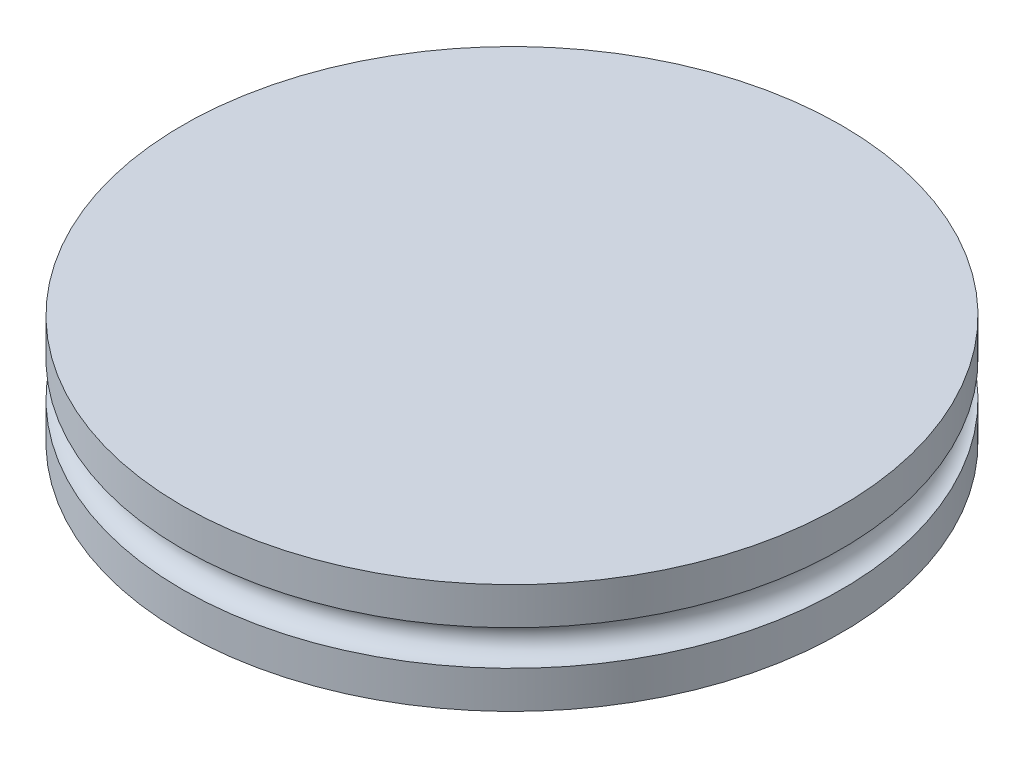
ISO-10303-21;
HEADER;
FILE_DESCRIPTION(('STEP AP214'),'2;1');
FILE_NAME('part.step','',(''),(''),'','','');
FILE_SCHEMA(('AUTOMOTIVE_DESIGN { 1 0 10303 214 1 1 1 1 }'));
ENDSEC;
DATA;
#1=APPLICATION_CONTEXT('core data for automotive mechanical design processes');
#2=APPLICATION_PROTOCOL_DEFINITION('international standard','automotive_design',2000,#1);
#3=PRODUCT_CONTEXT('',#1,'mechanical');
#4=PRODUCT('Part','Part','',(#3));
#5=PRODUCT_RELATED_PRODUCT_CATEGORY('part','',(#4));
#6=PRODUCT_DEFINITION_FORMATION('','',#4);
#7=PRODUCT_DEFINITION_CONTEXT('part definition',#1,'design');
#8=PRODUCT_DEFINITION('design','',#6,#7);
#9=PRODUCT_DEFINITION_SHAPE('','',#8);
#10=(LENGTH_UNIT() NAMED_UNIT(*) SI_UNIT(.MILLI.,.METRE.));
#11=(NAMED_UNIT(*) PLANE_ANGLE_UNIT() SI_UNIT($,.RADIAN.));
#12=(NAMED_UNIT(*) SI_UNIT($,.STERADIAN.) SOLID_ANGLE_UNIT());
#13=UNCERTAINTY_MEASURE_WITH_UNIT(LENGTH_MEASURE(1.E-05),#10,'distance_accuracy_value','');
#14=(GEOMETRIC_REPRESENTATION_CONTEXT(3) GLOBAL_UNCERTAINTY_ASSIGNED_CONTEXT((#13)) GLOBAL_UNIT_ASSIGNED_CONTEXT((#10,
#11,#12)) REPRESENTATION_CONTEXT('',''));
#15=CARTESIAN_POINT('',(0.,0.,0.));
#16=DIRECTION('',(0.,0.,1.));
#17=DIRECTION('',(1.,0.,0.));
#18=AXIS2_PLACEMENT_3D('',#15,#16,#17);
#19=CARTESIAN_POINT('',(-8.509,1.5875,-25.4));
#20=DIRECTION('',(0.,0.,1.));
#21=DIRECTION('',(1.,0.,0.));
#22=AXIS2_PLACEMENT_3D('',#19,#20,#21);
#23=CYLINDRICAL_SURFACE('',#22,0.508);
#24=DIRECTION('',(0.,0.,-1.));
#25=VECTOR('',#24,1.);
#26=CARTESIAN_POINT('',(-8.509,2.0955,-0.254));
#27=LINE('',#26,#25);
#28=CARTESIAN_POINT('',(-8.509,2.0955,-0.254000000000001));
#29=VERTEX_POINT('',#28);
#30=CARTESIAN_POINT('',(-8.509,2.0955,-4.28048408477359));
#31=VERTEX_POINT('',#30);
#32=EDGE_CURVE('E63',#29,#31,#27,.T.);
#33=ORIENTED_EDGE('',*,*,#32,.T.);
#34=CARTESIAN_POINT('',(-8.509,2.0955,-4.28048408477359));
#35=CARTESIAN_POINT('',(-8.50681940239708,2.0955000643981,-4.27996650738304));
#36=CARTESIAN_POINT('',(-8.50463851031945,2.09548601567002,-4.27944876479485));
#37=CARTESIAN_POINT('',(-8.47334904880648,2.09508220074798,-4.27201930151602));
#38=CARTESIAN_POINT('',(-8.44422351393519,2.09219517271686,-4.26508673484259));
#39=CARTESIAN_POINT('',(-8.38680525791417,2.08145280053674,-4.2513870031378));
#40=CARTESIAN_POINT('',(-8.35851501139858,2.07358399441802,-4.24462033803862));
#41=CARTESIAN_POINT('',(-8.3036379450045,2.05306136100023,-4.23146446656607));
#42=CARTESIAN_POINT('',(-8.27705035690713,2.0404097097057,-4.22507509006751));
#43=CARTESIAN_POINT('',(-8.22637851678168,2.01064540053796,-4.2128724650318));
#44=CARTESIAN_POINT('',(-8.20229255813756,1.99353581220859,-4.20705882385462));
#45=CARTESIAN_POINT('',(-8.15763485240061,1.95554209656544,-4.19626010379111));
#46=CARTESIAN_POINT('',(-8.13702246613401,1.93470851114163,-4.19126546482783));
#47=CARTESIAN_POINT('',(-8.09960560377008,1.88968652030876,-4.18218546511635));
#48=CARTESIAN_POINT('',(-8.0828010449163,1.86549818782767,-4.17810008460706));
#49=CARTESIAN_POINT('',(-8.05396792211863,1.81515831259967,-4.17108269505385));
#50=CARTESIAN_POINT('',(-8.04182209995606,1.78907788124975,-4.16812238895205));
#51=CARTESIAN_POINT('',(-8.02208439569524,1.73515210757441,-4.16330846045093));
#52=CARTESIAN_POINT('',(-8.01449168025129,1.70730708924988,-4.16145463553493));
#53=CARTESIAN_POINT('',(-8.00425436009856,1.65139931441966,-4.15895448351195));
#54=CARTESIAN_POINT('',(-8.00148963508401,1.62335981633516,-4.15827884380703));
#55=CARTESIAN_POINT('',(-8.00062961447883,1.56720620180456,-4.15806870967637));
#56=CARTESIAN_POINT('',(-8.00253391589941,1.53909209200748,-4.15853411676561));
#57=CARTESIAN_POINT('',(-8.01089917980249,1.48391636214976,-4.16057738036457));
#58=CARTESIAN_POINT('',(-8.01730895952353,1.4568464891871,-4.16214274120793));
#59=CARTESIAN_POINT('',(-8.03441991797102,1.40418517193594,-4.16631751013445));
#60=CARTESIAN_POINT('',(-8.04512124685026,1.3785937794124,-4.16892695474802));
#61=CARTESIAN_POINT('',(-8.07057806268156,1.32938425894122,-4.17512637644385));
#62=CARTESIAN_POINT('',(-8.08536509496164,1.30578343044661,-4.17872398168939));
#63=CARTESIAN_POINT('',(-8.11849983769822,1.26140073221084,-4.18677248214347));
#64=CARTESIAN_POINT('',(-8.13684750758897,1.2406188303587,-4.19122336763072));
#65=CARTESIAN_POINT('',(-8.17702057557481,1.20195053740836,-4.20095059978673));
#66=CARTESIAN_POINT('',(-8.19891525648102,1.18414028256764,-4.20624334207637));
#67=CARTESIAN_POINT('',(-8.24525377379702,1.15242425852231,-4.21742135560799));
#68=CARTESIAN_POINT('',(-8.26969940456381,1.13852126344814,-4.22330704383051));
#69=CARTESIAN_POINT('',(-8.32170663718023,1.11437488284996,-4.23580037013337));
#70=CARTESIAN_POINT('',(-8.34936240480426,1.10434544576437,-4.24242928785917));
#71=CARTESIAN_POINT('',(-8.40587990687785,1.08921968380006,-4.25594283598031));
#72=CARTESIAN_POINT('',(-8.43473899779311,1.08411308416058,-4.26282690249562));
#73=CARTESIAN_POINT('',(-8.47664883233584,1.08036610030065,-4.27279953796461));
#74=CARTESIAN_POINT('',(-8.4895503913122,1.07970830729675,-4.27586620386452));
#75=CARTESIAN_POINT('',(-8.50463823882929,1.07951405558197,-4.27944869912318));
#76=CARTESIAN_POINT('',(-8.50681911425831,1.07950001298847,-4.27996643762933));
#77=CARTESIAN_POINT('',(-8.509,1.0795,-4.28048408477359));
#78=B_SPLINE_CURVE_WITH_KNOTS('',3,(#34,#35,#36,#37,#38,#39,#40,#41,#42,#43,#44,#45,#46,#47,#48,
#49,#50,#51,#52,#53,#54,#55,#56,#57,#58,#59,#60,#61,#62,#63,#64,#65,#66,#67,#68,#69,#70,#71,#72,
#73,#74,#75,#76,#77),.UNSPECIFIED.,.F.,.F.,(4,2,2,2,2,2,2,2,2,2,2,2,2,2,2,2,2,2,2,2,2,4),(0.,
0.00672444468568713,0.0964719965739315,0.18646310927496,0.276413328771741,0.366301775342411,
0.455051935601106,0.543800166845524,0.630139412495297,0.716462850824484,0.800606218761628,
0.884742324447978,0.967937765284197,1.05113611721786,1.13499570587891,1.21885433919764,
1.30460999570339,1.39042638526051,1.48046906280469,1.57032339714413,1.61012375391311,
1.6168481985988),.UNSPECIFIED.);
#79=CARTESIAN_POINT('',(-8.509,1.0795,-4.28048408477359));
#80=VERTEX_POINT('',#79);
#81=EDGE_CURVE('E117',#31,#80,#78,.T.);
#82=ORIENTED_EDGE('',*,*,#81,.T.);
#83=DIRECTION('',(0.,0.,-1.));
#84=VECTOR('',#83,1.);
#85=CARTESIAN_POINT('',(-8.509,1.0795,-0.254));
#86=LINE('',#85,#84);
#87=CARTESIAN_POINT('',(-8.509,1.0795,-0.254));
#88=VERTEX_POINT('',#87);
#89=EDGE_CURVE('E144',#88,#80,#86,.T.);
#90=ORIENTED_EDGE('',*,*,#89,.F.);
#91=CARTESIAN_POINT('',(-8.509,1.5875,-0.254000000000001));
#92=DIRECTION('',(0.,0.,-1.));
#93=DIRECTION('',(-1.,0.,0.));
#94=AXIS2_PLACEMENT_3D('',#91,#92,#93);
#95=CIRCLE('',#94,0.508);
#96=EDGE_CURVE('E48',#29,#88,#95,.F.);
#97=ORIENTED_EDGE('',*,*,#96,.F.);
#98=EDGE_LOOP('',(#33,#82,#90,#97));
#99=FACE_BOUND('',#98,.T.);
#100=DIRECTION('',(0.,0.,1.));
#101=VECTOR('',#100,1.);
#102=CARTESIAN_POINT('',(-8.509,1.0795,0.254));
#103=LINE('',#102,#101);
#104=CARTESIAN_POINT('',(-8.509,1.0795,0.254000000000001));
#105=VERTEX_POINT('',#104);
#106=CARTESIAN_POINT('',(-8.509,1.0795,4.28048408477359));
#107=VERTEX_POINT('',#106);
#108=EDGE_CURVE('E108',#105,#107,#103,.T.);
#109=ORIENTED_EDGE('',*,*,#108,.T.);
#110=CARTESIAN_POINT('',(-8.509,1.0795,4.28048408477359));
#111=CARTESIAN_POINT('',(-8.50681940239708,1.0794999356019,4.27996650738303));
#112=CARTESIAN_POINT('',(-8.50463851031945,1.07951398432998,4.27944876479485));
#113=CARTESIAN_POINT('',(-8.47334904880648,1.07991779925202,4.27201930151602));
#114=CARTESIAN_POINT('',(-8.44422351393519,1.08280482728314,4.26508673484258));
#115=CARTESIAN_POINT('',(-8.38680525791418,1.09354719946326,4.2513870031378));
#116=CARTESIAN_POINT('',(-8.35851501139858,1.10141600558198,4.24462033803863));
#117=CARTESIAN_POINT('',(-8.3036379450045,1.12193863899977,4.23146446656608));
#118=CARTESIAN_POINT('',(-8.27705035690713,1.1345902902943,4.22507509006751));
#119=CARTESIAN_POINT('',(-8.22637851678168,1.16435459946204,4.2128724650318));
#120=CARTESIAN_POINT('',(-8.20229255813756,1.18146418779141,4.20705882385462));
#121=CARTESIAN_POINT('',(-8.15763485240061,1.21945790343456,4.19626010379112));
#122=CARTESIAN_POINT('',(-8.13702246613401,1.24029148885837,4.19126546482783));
#123=CARTESIAN_POINT('',(-8.09960560377008,1.28531347969124,4.18218546511635));
#124=CARTESIAN_POINT('',(-8.0828010449163,1.30950181217233,4.17810008460705));
#125=CARTESIAN_POINT('',(-8.05396792211863,1.35984168740033,4.17108269505385));
#126=CARTESIAN_POINT('',(-8.04182209995606,1.38592211875025,4.16812238895206));
#127=CARTESIAN_POINT('',(-8.02208439569524,1.43984789242559,4.16330846045093));
#128=CARTESIAN_POINT('',(-8.01449168025129,1.46769291075012,4.16145463553493));
#129=CARTESIAN_POINT('',(-8.00425436009856,1.52360068558034,4.15895448351195));
#130=CARTESIAN_POINT('',(-8.00148963508401,1.55164018366484,4.15827884380703));
#131=CARTESIAN_POINT('',(-8.00062961447883,1.60779379819544,4.15806870967637));
#132=CARTESIAN_POINT('',(-8.00253391589941,1.63590790799252,4.15853411676562));
#133=CARTESIAN_POINT('',(-8.01089917980249,1.69108363785024,4.16057738036457));
#134=CARTESIAN_POINT('',(-8.01730895952353,1.71815351081291,4.16214274120793));
#135=CARTESIAN_POINT('',(-8.03441991797102,1.77081482806406,4.16631751013445));
#136=CARTESIAN_POINT('',(-8.04512124685026,1.7964062205876,4.16892695474802));
#137=CARTESIAN_POINT('',(-8.07057806268156,1.84561574105878,4.17512637644386));
#138=CARTESIAN_POINT('',(-8.08536509496164,1.86921656955339,4.17872398168939));
#139=CARTESIAN_POINT('',(-8.11849983769823,1.91359926778916,4.18677248214347));
#140=CARTESIAN_POINT('',(-8.13684750758897,1.93438116964131,4.19122336763072));
#141=CARTESIAN_POINT('',(-8.17702057557482,1.97304946259164,4.20095059978673));
#142=CARTESIAN_POINT('',(-8.19891525648102,1.99085971743236,4.20624334207637));
#143=CARTESIAN_POINT('',(-8.24525377379702,2.02257574147769,4.21742135560799));
#144=CARTESIAN_POINT('',(-8.26969940456381,2.03647873655186,4.22330704383051));
#145=CARTESIAN_POINT('',(-8.32170663718023,2.06062511715004,4.23580037013337));
#146=CARTESIAN_POINT('',(-8.34936240480426,2.07065455423563,4.24242928785917));
#147=CARTESIAN_POINT('',(-8.40587990687785,2.08578031619993,4.25594283598031));
#148=CARTESIAN_POINT('',(-8.43473899779311,2.09088691583942,4.26282690249563));
#149=CARTESIAN_POINT('',(-8.47664883233584,2.09463389969935,4.2727995379646));
#150=CARTESIAN_POINT('',(-8.4895503913122,2.09529169270325,4.2758662038645));
#151=CARTESIAN_POINT('',(-8.5046382388293,2.09548594441803,4.27944869912318));
#152=CARTESIAN_POINT('',(-8.50681911425831,2.09549998701153,4.27996643762933));
#153=CARTESIAN_POINT('',(-8.509,2.0955,4.28048408477359));
#154=B_SPLINE_CURVE_WITH_KNOTS('',3,(#110,#111,#112,#113,#114,#115,#116,#117,#118,#119,#120,
#121,#122,#123,#124,#125,#126,#127,#128,#129,#130,#131,#132,#133,#134,#135,#136,#137,#138,#139,
#140,#141,#142,#143,#144,#145,#146,#147,#148,#149,#150,#151,#152,#153),.UNSPECIFIED.,.F.,.F.,(4,
2,2,2,2,2,2,2,2,2,2,2,2,2,2,2,2,2,2,2,2,4),(0.,0.00672444468568713,0.09647199657393,
0.186463109274961,0.276413328771741,0.366301775342412,0.455051935601108,0.543800166845527,
0.630139412495298,0.716462850824484,0.800606218761629,0.884742324447978,0.967937765284198,
1.05113611721786,1.13499570587891,1.21885433919764,1.30460999570339,1.39042638526051,
1.48046906280468,1.57032339714413,1.61012375391311,1.6168481985988),.UNSPECIFIED.);
#155=CARTESIAN_POINT('',(-8.509,2.0955,4.28048408477359));
#156=VERTEX_POINT('',#155);
#157=EDGE_CURVE('E114',#107,#156,#154,.T.);
#158=ORIENTED_EDGE('',*,*,#157,.T.);
#159=DIRECTION('',(0.,0.,1.));
#160=VECTOR('',#159,1.);
#161=CARTESIAN_POINT('',(-8.509,2.0955,0.254));
#162=LINE('',#161,#160);
#163=CARTESIAN_POINT('',(-8.509,2.0955,0.254));
#164=VERTEX_POINT('',#163);
#165=EDGE_CURVE('E123',#164,#156,#162,.T.);
#166=ORIENTED_EDGE('',*,*,#165,.F.);
#167=CARTESIAN_POINT('',(-8.509,1.5875,0.254000000000001));
#168=DIRECTION('',(0.,0.,-1.));
#169=DIRECTION('',(-1.,0.,0.));
#170=AXIS2_PLACEMENT_3D('',#167,#168,#169);
#171=CIRCLE('',#170,0.508);
#172=EDGE_CURVE('E11',#164,#105,#171,.F.);
#173=ORIENTED_EDGE('',*,*,#172,.T.);
#174=EDGE_LOOP('',(#109,#158,#166,#173));
#175=FACE_BOUND('',#174,.T.);
#176=ADVANCED_FACE('F39',(#99,#175),#23,.F.);
#177=CARTESIAN_POINT('',(0.,3.175,0.));
#178=DIRECTION('',(0.,-1.,0.));
#179=DIRECTION('',(0.,0.,-1.));
#180=AXIS2_PLACEMENT_3D('',#177,#178,#179);
#181=CYLINDRICAL_SURFACE('',#180,9.525);
#182=CARTESIAN_POINT('',(0.,1.0795,0.));
#183=DIRECTION('',(0.,1.,0.));
#184=DIRECTION('',(0.,0.,1.));
#185=AXIS2_PLACEMENT_3D('',#182,#183,#184);
#186=CIRCLE('',#185,9.525);
#187=CARTESIAN_POINT('',(-9.52161273104509,1.0795,-0.254));
#188=VERTEX_POINT('',#187);
#189=EDGE_CURVE('E153',#80,#188,#186,.T.);
#190=ORIENTED_EDGE('',*,*,#189,.F.);
#191=CARTESIAN_POINT('',(0.,1.0795,0.));
#192=DIRECTION('',(0.,1.,0.));
#193=DIRECTION('',(0.,0.,1.));
#194=AXIS2_PLACEMENT_3D('',#191,#192,#193);
#195=CIRCLE('',#194,9.525);
#196=EDGE_CURVE('E177',#80,#107,#195,.F.);
#197=ORIENTED_EDGE('',*,*,#196,.T.);
#198=CARTESIAN_POINT('',(0.,1.0795,0.));
#199=DIRECTION('',(0.,-1.,0.));
#200=DIRECTION('',(0.,0.,-1.));
#201=AXIS2_PLACEMENT_3D('',#198,#199,#200);
#202=CIRCLE('',#201,9.525);
#203=CARTESIAN_POINT('',(-9.52161273104509,1.0795,0.254));
#204=VERTEX_POINT('',#203);
#205=EDGE_CURVE('E107',#107,#204,#202,.T.);
#206=ORIENTED_EDGE('',*,*,#205,.T.);
#207=DIRECTION('',(0.,-1.,0.));
#208=VECTOR('',#207,1.);
#209=CARTESIAN_POINT('',(-9.52161273104509,2.0955,0.254));
#210=LINE('',#209,#208);
#211=CARTESIAN_POINT('',(-9.52161273104509,2.0955,0.254));
#212=VERTEX_POINT('',#211);
#213=EDGE_CURVE('E101',#212,#204,#210,.T.);
#214=ORIENTED_EDGE('',*,*,#213,.F.);
#215=CARTESIAN_POINT('',(0.,2.0955,0.));
#216=DIRECTION('',(0.,1.,0.));
#217=DIRECTION('',(0.,0.,1.));
#218=AXIS2_PLACEMENT_3D('',#215,#216,#217);
#219=CIRCLE('',#218,9.525);
#220=EDGE_CURVE('E95',#212,#156,#219,.T.);
#221=ORIENTED_EDGE('',*,*,#220,.T.);
#222=CARTESIAN_POINT('',(0.,2.0955,0.));
#223=DIRECTION('',(0.,-1.,0.));
#224=DIRECTION('',(0.,0.,-1.));
#225=AXIS2_PLACEMENT_3D('',#222,#223,#224);
#226=CIRCLE('',#225,9.525);
#227=EDGE_CURVE('E100',#156,#31,#226,.F.);
#228=ORIENTED_EDGE('',*,*,#227,.T.);
#229=CARTESIAN_POINT('',(0.,2.0955,0.));
#230=DIRECTION('',(0.,-1.,0.));
#231=DIRECTION('',(1.,0.,0.));
#232=AXIS2_PLACEMENT_3D('',#229,#230,#231);
#233=CIRCLE('',#232,9.525);
#234=CARTESIAN_POINT('',(-9.52161273104509,2.0955,-0.254));
#235=VERTEX_POINT('',#234);
#236=EDGE_CURVE('E156',#235,#31,#233,.T.);
#237=ORIENTED_EDGE('',*,*,#236,.F.);
#238=DIRECTION('',(0.,-1.,0.));
#239=VECTOR('',#238,1.);
#240=CARTESIAN_POINT('',(-9.52161273104509,3.175,-0.254));
#241=LINE('',#240,#239);
#242=EDGE_CURVE('E150',#188,#235,#241,.F.);
#243=ORIENTED_EDGE('',*,*,#242,.F.);
#244=EDGE_LOOP('',(#190,#197,#206,#214,#221,#228,#237,#243));
#245=FACE_BOUND('',#244,.T.);
#246=CARTESIAN_POINT('',(0.,0.,0.));
#247=DIRECTION('',(0.,1.,0.));
#248=DIRECTION('',(0.,0.,1.));
#249=AXIS2_PLACEMENT_3D('',#246,#247,#248);
#250=CIRCLE('',#249,9.525);
#251=CARTESIAN_POINT('',(0.,0.,9.525));
#252=VERTEX_POINT('',#251);
#253=EDGE_CURVE('E159',#252,#252,#250,.T.);
#254=ORIENTED_EDGE('',*,*,#253,.T.);
#255=EDGE_LOOP('',(#254));
#256=FACE_BOUND('',#255,.T.);
#257=CARTESIAN_POINT('',(0.,3.175,0.));
#258=DIRECTION('',(0.,1.,0.));
#259=DIRECTION('',(0.,0.,1.));
#260=AXIS2_PLACEMENT_3D('',#257,#258,#259);
#261=CIRCLE('',#260,9.525);
#262=CARTESIAN_POINT('',(0.,3.175,9.525));
#263=VERTEX_POINT('',#262);
#264=EDGE_CURVE('E160',#263,#263,#261,.T.);
#265=ORIENTED_EDGE('',*,*,#264,.F.);
#266=EDGE_LOOP('',(#265));
#267=FACE_BOUND('',#266,.T.);
#268=ADVANCED_FACE('F41',(#245,#256,#267),#181,.T.);
#269=CARTESIAN_POINT('',(0.,3.175,0.));
#270=DIRECTION('',(0.,1.,0.));
#271=DIRECTION('',(0.,0.,1.));
#272=AXIS2_PLACEMENT_3D('',#269,#270,#271);
#273=PLANE('',#272);
#274=ORIENTED_EDGE('',*,*,#264,.T.);
#275=EDGE_LOOP('',(#274));
#276=FACE_BOUND('',#275,.T.);
#277=ADVANCED_FACE('F217',(#276),#273,.T.);
#278=CARTESIAN_POINT('',(0.,0.,0.));
#279=DIRECTION('',(0.,1.,0.));
#280=DIRECTION('',(0.,0.,1.));
#281=AXIS2_PLACEMENT_3D('',#278,#279,#280);
#282=PLANE('',#281);
#283=ORIENTED_EDGE('',*,*,#253,.F.);
#284=EDGE_LOOP('',(#283));
#285=FACE_BOUND('',#284,.T.);
#286=ADVANCED_FACE('F213',(#285),#282,.F.);
#287=CARTESIAN_POINT('',(-8.509,2.0955,-0.254));
#288=DIRECTION('',(0.,-1.,0.));
#289=DIRECTION('',(1.,0.,0.));
#290=AXIS2_PLACEMENT_3D('',#287,#288,#289);
#291=PLANE('',#290);
#292=ORIENTED_EDGE('',*,*,#236,.T.);
#293=ORIENTED_EDGE('',*,*,#32,.F.);
#294=DIRECTION('',(-1.,0.,0.));
#295=VECTOR('',#294,1.);
#296=CARTESIAN_POINT('',(-8.509,2.0955,-0.254));
#297=LINE('',#296,#295);
#298=EDGE_CURVE('E137',#29,#235,#297,.T.);
#299=ORIENTED_EDGE('',*,*,#298,.T.);
#300=EDGE_LOOP('',(#292,#293,#299));
#301=FACE_BOUND('',#300,.T.);
#302=ADVANCED_FACE('F211',(#301),#291,.T.);
#303=CARTESIAN_POINT('',(-8.509,1.0795,-0.254));
#304=DIRECTION('',(0.,1.,0.));
#305=DIRECTION('',(0.,0.,1.));
#306=AXIS2_PLACEMENT_3D('',#303,#304,#305);
#307=PLANE('',#306);
#308=ORIENTED_EDGE('',*,*,#189,.T.);
#309=DIRECTION('',(1.,0.,0.));
#310=VECTOR('',#309,1.);
#311=CARTESIAN_POINT('',(-8.509,1.0795,-0.254));
#312=LINE('',#311,#310);
#313=EDGE_CURVE('E140',#188,#88,#312,.T.);
#314=ORIENTED_EDGE('',*,*,#313,.T.);
#315=ORIENTED_EDGE('',*,*,#89,.T.);
#316=EDGE_LOOP('',(#308,#314,#315));
#317=FACE_BOUND('',#316,.T.);
#318=ADVANCED_FACE('F175',(#317),#307,.T.);
#319=CARTESIAN_POINT('',(0.,0.,-0.254));
#320=DIRECTION('',(0.,0.,-1.));
#321=DIRECTION('',(-1.,0.,0.));
#322=AXIS2_PLACEMENT_3D('',#319,#320,#321);
#323=PLANE('',#322);
#324=ORIENTED_EDGE('',*,*,#242,.T.);
#325=ORIENTED_EDGE('',*,*,#298,.F.);
#326=ORIENTED_EDGE('',*,*,#96,.T.);
#327=ORIENTED_EDGE('',*,*,#313,.F.);
#328=EDGE_LOOP('',(#324,#325,#326,#327));
#329=FACE_BOUND('',#328,.T.);
#330=ADVANCED_FACE('F170',(#329),#323,.T.);
#331=CARTESIAN_POINT('',(-8.509,1.0795,0.254));
#332=DIRECTION('',(0.,-1.,0.));
#333=DIRECTION('',(0.,0.,-1.));
#334=AXIS2_PLACEMENT_3D('',#331,#332,#333);
#335=PLANE('',#334);
#336=ORIENTED_EDGE('',*,*,#108,.F.);
#337=DIRECTION('',(1.,0.,0.));
#338=VECTOR('',#337,1.);
#339=CARTESIAN_POINT('',(-8.509,1.0795,0.254));
#340=LINE('',#339,#338);
#341=EDGE_CURVE('E55',#204,#105,#340,.T.);
#342=ORIENTED_EDGE('',*,*,#341,.F.);
#343=ORIENTED_EDGE('',*,*,#205,.F.);
#344=EDGE_LOOP('',(#336,#342,#343));
#345=FACE_BOUND('',#344,.T.);
#346=ADVANCED_FACE('F202',(#345),#335,.F.);
#347=CARTESIAN_POINT('',(-8.509,2.0955,0.254));
#348=DIRECTION('',(0.,1.,0.));
#349=DIRECTION('',(0.,0.,1.));
#350=AXIS2_PLACEMENT_3D('',#347,#348,#349);
#351=PLANE('',#350);
#352=DIRECTION('',(-1.,0.,0.));
#353=VECTOR('',#352,1.);
#354=CARTESIAN_POINT('',(-8.509,2.0955,0.254));
#355=LINE('',#354,#353);
#356=EDGE_CURVE('E127',#164,#212,#355,.T.);
#357=ORIENTED_EDGE('',*,*,#356,.F.);
#358=ORIENTED_EDGE('',*,*,#165,.T.);
#359=ORIENTED_EDGE('',*,*,#220,.F.);
#360=EDGE_LOOP('',(#357,#358,#359));
#361=FACE_BOUND('',#360,.T.);
#362=ADVANCED_FACE('F126',(#361),#351,.F.);
#363=CARTESIAN_POINT('',(0.,0.,0.254));
#364=DIRECTION('',(0.,0.,-1.));
#365=DIRECTION('',(-1.,0.,0.));
#366=AXIS2_PLACEMENT_3D('',#363,#364,#365);
#367=PLANE('',#366);
#368=ORIENTED_EDGE('',*,*,#356,.T.);
#369=ORIENTED_EDGE('',*,*,#213,.T.);
#370=ORIENTED_EDGE('',*,*,#341,.T.);
#371=ORIENTED_EDGE('',*,*,#172,.F.);
#372=EDGE_LOOP('',(#368,#369,#370,#371));
#373=FACE_BOUND('',#372,.T.);
#374=ADVANCED_FACE('F198',(#373),#367,.F.);
#375=CARTESIAN_POINT('',(0.,1.5875,0.));
#376=DIRECTION('',(0.,-1.,0.));
#377=DIRECTION('',(0.,0.,-1.));
#378=AXIS2_PLACEMENT_3D('',#375,#376,#377);
#379=TOROIDAL_SURFACE('',#378,9.525,0.508000000000002);
#380=ORIENTED_EDGE('',*,*,#81,.F.);
#381=ORIENTED_EDGE('',*,*,#227,.F.);
#382=ORIENTED_EDGE('',*,*,#157,.F.);
#383=ORIENTED_EDGE('',*,*,#196,.F.);
#384=EDGE_LOOP('',(#380,#381,#382,#383));
#385=FACE_BOUND('',#384,.T.);
#386=ADVANCED_FACE('F113',(#385),#379,.F.);
#387=CLOSED_SHELL('',(#176,#268,#277,#286,#302,#318,#330,#346,#362,#374,#386));
#388=MANIFOLD_SOLID_BREP('B2',#387);
#389=ADVANCED_BREP_SHAPE_REPRESENTATION('',(#18,#388),#14);
#390=SHAPE_DEFINITION_REPRESENTATION(#9,#389);
ENDSEC;
END-ISO-10303-21;
